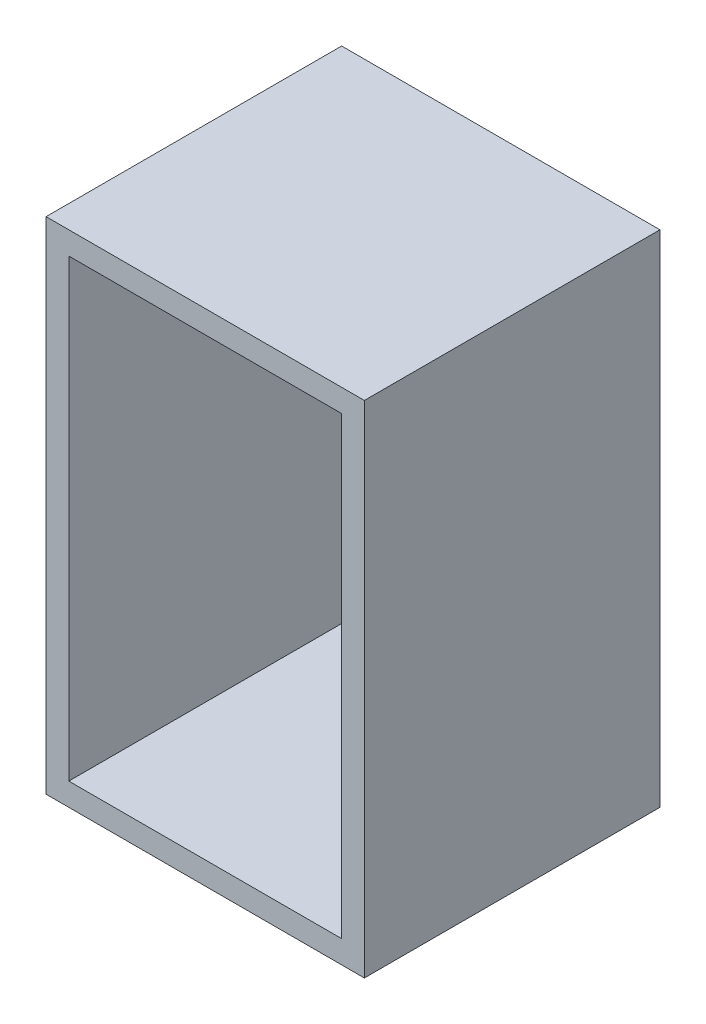
ISO-10303-21;
HEADER;
FILE_DESCRIPTION(('STEP AP214'),'2;1');
FILE_NAME('part.step','',(''),(''),'','','');
FILE_SCHEMA(('AUTOMOTIVE_DESIGN { 1 0 10303 214 1 1 1 1 }'));
ENDSEC;
DATA;
#1=APPLICATION_CONTEXT('core data for automotive mechanical design processes');
#2=APPLICATION_PROTOCOL_DEFINITION('international standard','automotive_design',2000,#1);
#3=PRODUCT_CONTEXT('',#1,'mechanical');
#4=PRODUCT('Part','Part','',(#3));
#5=PRODUCT_RELATED_PRODUCT_CATEGORY('part','',(#4));
#6=PRODUCT_DEFINITION_FORMATION('','',#4);
#7=PRODUCT_DEFINITION_CONTEXT('part definition',#1,'design');
#8=PRODUCT_DEFINITION('design','',#6,#7);
#9=PRODUCT_DEFINITION_SHAPE('','',#8);
#10=(LENGTH_UNIT() NAMED_UNIT(*) SI_UNIT(.MILLI.,.METRE.));
#11=(NAMED_UNIT(*) PLANE_ANGLE_UNIT() SI_UNIT($,.RADIAN.));
#12=(NAMED_UNIT(*) SI_UNIT($,.STERADIAN.) SOLID_ANGLE_UNIT());
#13=UNCERTAINTY_MEASURE_WITH_UNIT(LENGTH_MEASURE(1.E-05),#10,'distance_accuracy_value','');
#14=(GEOMETRIC_REPRESENTATION_CONTEXT(3) GLOBAL_UNCERTAINTY_ASSIGNED_CONTEXT((#13)) GLOBAL_UNIT_ASSIGNED_CONTEXT((#10,
#11,#12)) REPRESENTATION_CONTEXT('',''));
#15=CARTESIAN_POINT('',(0.,0.,0.));
#16=DIRECTION('',(0.,0.,1.));
#17=DIRECTION('',(1.,0.,0.));
#18=AXIS2_PLACEMENT_3D('',#15,#16,#17);
#19=CARTESIAN_POINT('',(-177.8,279.4,25.4));
#20=DIRECTION('',(1.,0.,0.));
#21=DIRECTION('',(0.,1.,0.));
#22=AXIS2_PLACEMENT_3D('',#19,#20,#21);
#23=PLANE('',#22);
#24=DIRECTION('',(0.,-1.,0.));
#25=VECTOR('',#24,1.);
#26=CARTESIAN_POINT('',(-177.8,279.4,0.));
#27=LINE('',#26,#25);
#28=CARTESIAN_POINT('',(-177.8,279.4,0.));
#29=VERTEX_POINT('',#28);
#30=CARTESIAN_POINT('',(-177.8,-279.4,0.));
#31=VERTEX_POINT('',#30);
#32=EDGE_CURVE('E167',#29,#31,#27,.T.);
#33=ORIENTED_EDGE('',*,*,#32,.T.);
#34=DIRECTION('',(0.,0.,-1.));
#35=VECTOR('',#34,1.);
#36=CARTESIAN_POINT('',(-177.8,-279.4,25.4));
#37=LINE('',#36,#35);
#38=CARTESIAN_POINT('',(-177.8,-279.4,330.2));
#39=VERTEX_POINT('',#38);
#40=EDGE_CURVE('E11',#39,#31,#37,.T.);
#41=ORIENTED_EDGE('',*,*,#40,.F.);
#42=DIRECTION('',(0.,-1.,0.));
#43=VECTOR('',#42,1.);
#44=CARTESIAN_POINT('',(-177.8,-279.4,330.2));
#45=LINE('',#44,#43);
#46=CARTESIAN_POINT('',(-177.8,279.4,330.2));
#47=VERTEX_POINT('',#46);
#48=EDGE_CURVE('E120',#47,#39,#45,.T.);
#49=ORIENTED_EDGE('',*,*,#48,.F.);
#50=DIRECTION('',(0.,0.,-1.));
#51=VECTOR('',#50,1.);
#52=CARTESIAN_POINT('',(-177.8,279.4,25.4));
#53=LINE('',#52,#51);
#54=EDGE_CURVE('E180',#47,#29,#53,.T.);
#55=ORIENTED_EDGE('',*,*,#54,.T.);
#56=EDGE_LOOP('',(#33,#41,#49,#55));
#57=FACE_BOUND('',#56,.T.);
#58=ADVANCED_FACE('F39',(#57),#23,.F.);
#59=CARTESIAN_POINT('',(-177.8,-279.4,25.4));
#60=DIRECTION('',(0.,1.,0.));
#61=DIRECTION('',(0.,0.,1.));
#62=AXIS2_PLACEMENT_3D('',#59,#60,#61);
#63=PLANE('',#62);
#64=DIRECTION('',(1.,0.,0.));
#65=VECTOR('',#64,1.);
#66=CARTESIAN_POINT('',(-177.8,-279.4,0.));
#67=LINE('',#66,#65);
#68=CARTESIAN_POINT('',(177.8,-279.4,0.));
#69=VERTEX_POINT('',#68);
#70=EDGE_CURVE('E171',#31,#69,#67,.T.);
#71=ORIENTED_EDGE('',*,*,#70,.T.);
#72=DIRECTION('',(0.,0.,-1.));
#73=VECTOR('',#72,1.);
#74=CARTESIAN_POINT('',(177.8,-279.4,25.4));
#75=LINE('',#74,#73);
#76=CARTESIAN_POINT('',(177.8,-279.4,330.2));
#77=VERTEX_POINT('',#76);
#78=EDGE_CURVE('E47',#77,#69,#75,.T.);
#79=ORIENTED_EDGE('',*,*,#78,.F.);
#80=DIRECTION('',(1.,0.,0.));
#81=VECTOR('',#80,1.);
#82=CARTESIAN_POINT('',(177.8,-279.4,330.2));
#83=LINE('',#82,#81);
#84=EDGE_CURVE('E155',#39,#77,#83,.T.);
#85=ORIENTED_EDGE('',*,*,#84,.F.);
#86=ORIENTED_EDGE('',*,*,#40,.T.);
#87=EDGE_LOOP('',(#71,#79,#85,#86));
#88=FACE_BOUND('',#87,.T.);
#89=ADVANCED_FACE('F205',(#88),#63,.F.);
#90=CARTESIAN_POINT('',(177.8,279.4,25.4));
#91=DIRECTION('',(-1.,0.,0.));
#92=DIRECTION('',(0.,0.,1.));
#93=AXIS2_PLACEMENT_3D('',#90,#91,#92);
#94=PLANE('',#93);
#95=DIRECTION('',(0.,1.,0.));
#96=VECTOR('',#95,1.);
#97=CARTESIAN_POINT('',(177.8,279.4,0.));
#98=LINE('',#97,#96);
#99=CARTESIAN_POINT('',(177.8,279.4,0.));
#100=VERTEX_POINT('',#99);
#101=EDGE_CURVE('E174',#69,#100,#98,.T.);
#102=ORIENTED_EDGE('',*,*,#101,.T.);
#103=DIRECTION('',(0.,0.,-1.));
#104=VECTOR('',#103,1.);
#105=CARTESIAN_POINT('',(177.8,279.4,25.4));
#106=LINE('',#105,#104);
#107=CARTESIAN_POINT('',(177.8,279.4,330.2));
#108=VERTEX_POINT('',#107);
#109=EDGE_CURVE('E184',#108,#100,#106,.T.);
#110=ORIENTED_EDGE('',*,*,#109,.F.);
#111=DIRECTION('',(0.,1.,0.));
#112=VECTOR('',#111,1.);
#113=CARTESIAN_POINT('',(177.8,279.4,330.2));
#114=LINE('',#113,#112);
#115=EDGE_CURVE('E159',#77,#108,#114,.T.);
#116=ORIENTED_EDGE('',*,*,#115,.F.);
#117=ORIENTED_EDGE('',*,*,#78,.T.);
#118=EDGE_LOOP('',(#102,#110,#116,#117));
#119=FACE_BOUND('',#118,.T.);
#120=ADVANCED_FACE('F192',(#119),#94,.F.);
#121=CARTESIAN_POINT('',(-177.8,279.4,25.4));
#122=DIRECTION('',(0.,-1.,0.));
#123=DIRECTION('',(0.,0.,-1.));
#124=AXIS2_PLACEMENT_3D('',#121,#122,#123);
#125=PLANE('',#124);
#126=DIRECTION('',(-1.,0.,0.));
#127=VECTOR('',#126,1.);
#128=CARTESIAN_POINT('',(-177.8,279.4,0.));
#129=LINE('',#128,#127);
#130=EDGE_CURVE('E177',#100,#29,#129,.T.);
#131=ORIENTED_EDGE('',*,*,#130,.T.);
#132=ORIENTED_EDGE('',*,*,#54,.F.);
#133=DIRECTION('',(-1.,0.,0.));
#134=VECTOR('',#133,1.);
#135=CARTESIAN_POINT('',(-177.8,279.4,330.2));
#136=LINE('',#135,#134);
#137=EDGE_CURVE('E163',#108,#47,#136,.T.);
#138=ORIENTED_EDGE('',*,*,#137,.F.);
#139=ORIENTED_EDGE('',*,*,#109,.T.);
#140=EDGE_LOOP('',(#131,#132,#138,#139));
#141=FACE_BOUND('',#140,.T.);
#142=ADVANCED_FACE('F200',(#141),#125,.F.);
#143=CARTESIAN_POINT('',(0.,0.,0.));
#144=DIRECTION('',(0.,0.,1.));
#145=DIRECTION('',(1.,0.,0.));
#146=AXIS2_PLACEMENT_3D('',#143,#144,#145);
#147=PLANE('',#146);
#148=ORIENTED_EDGE('',*,*,#32,.F.);
#149=ORIENTED_EDGE('',*,*,#130,.F.);
#150=ORIENTED_EDGE('',*,*,#101,.F.);
#151=ORIENTED_EDGE('',*,*,#70,.F.);
#152=EDGE_LOOP('',(#148,#149,#150,#151));
#153=FACE_BOUND('',#152,.T.);
#154=ADVANCED_FACE('F198',(#153),#147,.F.);
#155=CARTESIAN_POINT('',(0.,0.,330.2));
#156=DIRECTION('',(0.,0.,-1.));
#157=DIRECTION('',(-1.,0.,0.));
#158=AXIS2_PLACEMENT_3D('',#155,#156,#157);
#159=PLANE('',#158);
#160=ORIENTED_EDGE('',*,*,#48,.T.);
#161=ORIENTED_EDGE('',*,*,#84,.T.);
#162=ORIENTED_EDGE('',*,*,#115,.T.);
#163=ORIENTED_EDGE('',*,*,#137,.T.);
#164=EDGE_LOOP('',(#160,#161,#162,#163));
#165=FACE_BOUND('',#164,.T.);
#166=DIRECTION('',(0.,-1.,0.));
#167=VECTOR('',#166,1.);
#168=CARTESIAN_POINT('',(-152.4,-254.,330.2));
#169=LINE('',#168,#167);
#170=CARTESIAN_POINT('',(-152.4,254.,330.2));
#171=VERTEX_POINT('',#170);
#172=CARTESIAN_POINT('',(-152.4,-254.,330.2));
#173=VERTEX_POINT('',#172);
#174=EDGE_CURVE('E103',#171,#173,#169,.T.);
#175=ORIENTED_EDGE('',*,*,#174,.F.);
#176=DIRECTION('',(-1.,0.,0.));
#177=VECTOR('',#176,1.);
#178=CARTESIAN_POINT('',(-152.4,254.,330.2));
#179=LINE('',#178,#177);
#180=CARTESIAN_POINT('',(152.4,254.,330.2));
#181=VERTEX_POINT('',#180);
#182=EDGE_CURVE('E130',#181,#171,#179,.T.);
#183=ORIENTED_EDGE('',*,*,#182,.F.);
#184=DIRECTION('',(0.,1.,0.));
#185=VECTOR('',#184,1.);
#186=CARTESIAN_POINT('',(152.4,254.,330.2));
#187=LINE('',#186,#185);
#188=CARTESIAN_POINT('',(152.4,-254.,330.2));
#189=VERTEX_POINT('',#188);
#190=EDGE_CURVE('E126',#189,#181,#187,.T.);
#191=ORIENTED_EDGE('',*,*,#190,.F.);
#192=DIRECTION('',(1.,0.,0.));
#193=VECTOR('',#192,1.);
#194=CARTESIAN_POINT('',(152.4,-254.,330.2));
#195=LINE('',#194,#193);
#196=EDGE_CURVE('E113',#173,#189,#195,.T.);
#197=ORIENTED_EDGE('',*,*,#196,.F.);
#198=EDGE_LOOP('',(#175,#183,#191,#197));
#199=FACE_BOUND('',#198,.T.);
#200=ADVANCED_FACE('F124',(#165,#199),#159,.F.);
#201=CARTESIAN_POINT('',(-152.4,-254.,330.2));
#202=DIRECTION('',(1.,0.,0.));
#203=DIRECTION('',(0.,0.,-1.));
#204=AXIS2_PLACEMENT_3D('',#201,#202,#203);
#205=PLANE('',#204);
#206=DIRECTION('',(0.,-1.,0.));
#207=VECTOR('',#206,1.);
#208=CARTESIAN_POINT('',(-152.4,-254.,25.4));
#209=LINE('',#208,#207);
#210=CARTESIAN_POINT('',(-152.4,254.,25.4));
#211=VERTEX_POINT('',#210);
#212=CARTESIAN_POINT('',(-152.4,-254.,25.4));
#213=VERTEX_POINT('',#212);
#214=EDGE_CURVE('E54',#211,#213,#209,.T.);
#215=ORIENTED_EDGE('',*,*,#214,.F.);
#216=DIRECTION('',(0.,0.,-1.));
#217=VECTOR('',#216,1.);
#218=CARTESIAN_POINT('',(-152.4,254.,330.2));
#219=LINE('',#218,#217);
#220=EDGE_CURVE('E108',#171,#211,#219,.T.);
#221=ORIENTED_EDGE('',*,*,#220,.F.);
#222=ORIENTED_EDGE('',*,*,#174,.T.);
#223=DIRECTION('',(0.,0.,-1.));
#224=VECTOR('',#223,1.);
#225=CARTESIAN_POINT('',(-152.4,-254.,330.2));
#226=LINE('',#225,#224);
#227=EDGE_CURVE('E106',#173,#213,#226,.T.);
#228=ORIENTED_EDGE('',*,*,#227,.T.);
#229=EDGE_LOOP('',(#215,#221,#222,#228));
#230=FACE_BOUND('',#229,.T.);
#231=ADVANCED_FACE('F105',(#230),#205,.T.);
#232=CARTESIAN_POINT('',(152.4,-254.,330.2));
#233=DIRECTION('',(0.,1.,0.));
#234=DIRECTION('',(-1.,0.,0.));
#235=AXIS2_PLACEMENT_3D('',#232,#233,#234);
#236=PLANE('',#235);
#237=DIRECTION('',(1.,0.,0.));
#238=VECTOR('',#237,1.);
#239=CARTESIAN_POINT('',(152.4,-254.,25.4));
#240=LINE('',#239,#238);
#241=CARTESIAN_POINT('',(152.4,-254.,25.4));
#242=VERTEX_POINT('',#241);
#243=EDGE_CURVE('E58',#213,#242,#240,.T.);
#244=ORIENTED_EDGE('',*,*,#243,.F.);
#245=ORIENTED_EDGE('',*,*,#227,.F.);
#246=ORIENTED_EDGE('',*,*,#196,.T.);
#247=DIRECTION('',(0.,0.,-1.));
#248=VECTOR('',#247,1.);
#249=CARTESIAN_POINT('',(152.4,-254.,330.2));
#250=LINE('',#249,#248);
#251=EDGE_CURVE('E121',#189,#242,#250,.T.);
#252=ORIENTED_EDGE('',*,*,#251,.T.);
#253=EDGE_LOOP('',(#244,#245,#246,#252));
#254=FACE_BOUND('',#253,.T.);
#255=ADVANCED_FACE('F117',(#254),#236,.T.);
#256=CARTESIAN_POINT('',(152.4,254.,330.2));
#257=DIRECTION('',(-1.,0.,0.));
#258=DIRECTION('',(0.,-1.,0.));
#259=AXIS2_PLACEMENT_3D('',#256,#257,#258);
#260=PLANE('',#259);
#261=DIRECTION('',(0.,1.,0.));
#262=VECTOR('',#261,1.);
#263=CARTESIAN_POINT('',(152.4,254.,25.4));
#264=LINE('',#263,#262);
#265=CARTESIAN_POINT('',(152.4,254.,25.4));
#266=VERTEX_POINT('',#265);
#267=EDGE_CURVE('E139',#242,#266,#264,.T.);
#268=ORIENTED_EDGE('',*,*,#267,.F.);
#269=ORIENTED_EDGE('',*,*,#251,.F.);
#270=ORIENTED_EDGE('',*,*,#190,.T.);
#271=DIRECTION('',(0.,0.,-1.));
#272=VECTOR('',#271,1.);
#273=CARTESIAN_POINT('',(152.4,254.,330.2));
#274=LINE('',#273,#272);
#275=EDGE_CURVE('E146',#181,#266,#274,.T.);
#276=ORIENTED_EDGE('',*,*,#275,.T.);
#277=EDGE_LOOP('',(#268,#269,#270,#276));
#278=FACE_BOUND('',#277,.T.);
#279=ADVANCED_FACE('F227',(#278),#260,.T.);
#280=CARTESIAN_POINT('',(-152.4,254.,330.2));
#281=DIRECTION('',(0.,-1.,0.));
#282=DIRECTION('',(0.,0.,-1.));
#283=AXIS2_PLACEMENT_3D('',#280,#281,#282);
#284=PLANE('',#283);
#285=DIRECTION('',(-1.,0.,0.));
#286=VECTOR('',#285,1.);
#287=CARTESIAN_POINT('',(-152.4,254.,25.4));
#288=LINE('',#287,#286);
#289=EDGE_CURVE('E114',#266,#211,#288,.T.);
#290=ORIENTED_EDGE('',*,*,#289,.F.);
#291=ORIENTED_EDGE('',*,*,#275,.F.);
#292=ORIENTED_EDGE('',*,*,#182,.T.);
#293=ORIENTED_EDGE('',*,*,#220,.T.);
#294=EDGE_LOOP('',(#290,#291,#292,#293));
#295=FACE_BOUND('',#294,.T.);
#296=ADVANCED_FACE('F220',(#295),#284,.T.);
#297=CARTESIAN_POINT('',(0.,0.,25.4));
#298=DIRECTION('',(0.,0.,1.));
#299=DIRECTION('',(1.,0.,0.));
#300=AXIS2_PLACEMENT_3D('',#297,#298,#299);
#301=PLANE('',#300);
#302=ORIENTED_EDGE('',*,*,#214,.T.);
#303=ORIENTED_EDGE('',*,*,#243,.T.);
#304=ORIENTED_EDGE('',*,*,#267,.T.);
#305=ORIENTED_EDGE('',*,*,#289,.T.);
#306=EDGE_LOOP('',(#302,#303,#304,#305));
#307=FACE_BOUND('',#306,.T.);
#308=ADVANCED_FACE('F217',(#307),#301,.T.);
#309=CLOSED_SHELL('',(#58,#89,#120,#142,#154,#200,#231,#255,#279,#296,#308));
#310=MANIFOLD_SOLID_BREP('B2',#309);
#311=ADVANCED_BREP_SHAPE_REPRESENTATION('',(#18,#310),#14);
#312=SHAPE_DEFINITION_REPRESENTATION(#9,#311);
ENDSEC;
END-ISO-10303-21;
